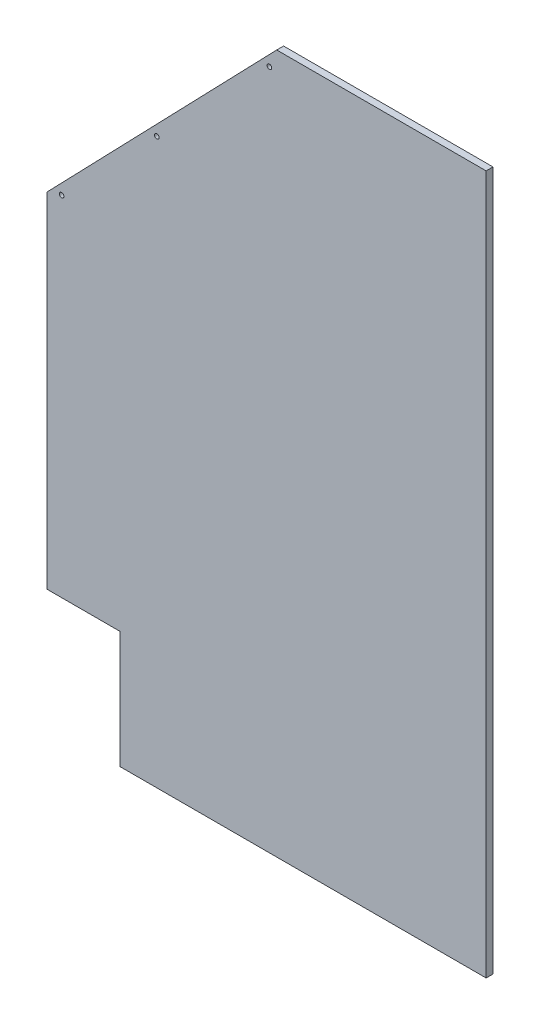
ISO-10303-21;
HEADER;
FILE_DESCRIPTION(('STEP AP214'),'2;1');
FILE_NAME('part.step','',(''),(''),'','','');
FILE_SCHEMA(('AUTOMOTIVE_DESIGN { 1 0 10303 214 1 1 1 1 }'));
ENDSEC;
DATA;
#1=APPLICATION_CONTEXT('core data for automotive mechanical design processes');
#2=APPLICATION_PROTOCOL_DEFINITION('international standard','automotive_design',2000,#1);
#3=PRODUCT_CONTEXT('',#1,'mechanical');
#4=PRODUCT('Part','Part','',(#3));
#5=PRODUCT_RELATED_PRODUCT_CATEGORY('part','',(#4));
#6=PRODUCT_DEFINITION_FORMATION('','',#4);
#7=PRODUCT_DEFINITION_CONTEXT('part definition',#1,'design');
#8=PRODUCT_DEFINITION('design','',#6,#7);
#9=PRODUCT_DEFINITION_SHAPE('','',#8);
#10=(LENGTH_UNIT() NAMED_UNIT(*) SI_UNIT(.MILLI.,.METRE.));
#11=(NAMED_UNIT(*) PLANE_ANGLE_UNIT() SI_UNIT($,.RADIAN.));
#12=(NAMED_UNIT(*) SI_UNIT($,.STERADIAN.) SOLID_ANGLE_UNIT());
#13=UNCERTAINTY_MEASURE_WITH_UNIT(LENGTH_MEASURE(1.E-05),#10,'distance_accuracy_value','');
#14=(GEOMETRIC_REPRESENTATION_CONTEXT(3) GLOBAL_UNCERTAINTY_ASSIGNED_CONTEXT((#13)) GLOBAL_UNIT_ASSIGNED_CONTEXT((#10,
#11,#12)) REPRESENTATION_CONTEXT('',''));
#15=CARTESIAN_POINT('',(0.,0.,0.));
#16=DIRECTION('',(0.,0.,1.));
#17=DIRECTION('',(1.,0.,0.));
#18=AXIS2_PLACEMENT_3D('',#15,#16,#17);
#19=CARTESIAN_POINT('',(0.,0.,0.));
#20=DIRECTION('',(0.,0.,-1.));
#21=DIRECTION('',(-1.,0.,0.));
#22=AXIS2_PLACEMENT_3D('',#19,#20,#21);
#23=PLANE('',#22);
#24=DIRECTION('',(0.,-1.,0.));
#25=VECTOR('',#24,1.);
#26=CARTESIAN_POINT('',(433.467396061269,-727.304266958425,0.));
#27=LINE('',#26,#25);
#28=CARTESIAN_POINT('',(433.467396061269,485.545733041575,0.));
#29=VERTEX_POINT('',#28);
#30=CARTESIAN_POINT('',(433.467396061269,-727.304266958425,0.));
#31=VERTEX_POINT('',#30);
#32=EDGE_CURVE('E150',#29,#31,#27,.T.);
#33=ORIENTED_EDGE('',*,*,#32,.T.);
#34=DIRECTION('',(1.,0.,0.));
#35=VECTOR('',#34,1.);
#36=CARTESIAN_POINT('',(-201.532603938731,-727.304266958425,0.));
#37=LINE('',#36,#35);
#38=CARTESIAN_POINT('',(-201.532603938731,-727.304266958425,0.));
#39=VERTEX_POINT('',#38);
#40=EDGE_CURVE('E133',#39,#31,#37,.T.);
#41=ORIENTED_EDGE('',*,*,#40,.F.);
#42=DIRECTION('',(0.,-1.,0.));
#43=VECTOR('',#42,1.);
#44=CARTESIAN_POINT('',(-201.532603938731,-524.104266958425,0.));
#45=LINE('',#44,#43);
#46=CARTESIAN_POINT('',(-201.532603938731,-524.104266958425,0.));
#47=VERTEX_POINT('',#46);
#48=EDGE_CURVE('E80',#47,#39,#45,.T.);
#49=ORIENTED_EDGE('',*,*,#48,.F.);
#50=DIRECTION('',(1.,0.,0.));
#51=VECTOR('',#50,1.);
#52=CARTESIAN_POINT('',(-328.532603938731,-524.104266958425,0.));
#53=LINE('',#52,#51);
#54=CARTESIAN_POINT('',(-328.532603938731,-524.104266958425,0.));
#55=VERTEX_POINT('',#54);
#56=EDGE_CURVE('E130',#55,#47,#53,.T.);
#57=ORIENTED_EDGE('',*,*,#56,.F.);
#58=DIRECTION('',(0.,-1.,0.));
#59=VECTOR('',#58,1.);
#60=CARTESIAN_POINT('',(-328.532603938731,72.7957330415754,0.));
#61=LINE('',#60,#59);
#62=CARTESIAN_POINT('',(-328.532603938731,72.7957330415754,0.));
#63=VERTEX_POINT('',#62);
#64=EDGE_CURVE('E111',#63,#55,#61,.T.);
#65=ORIENTED_EDGE('',*,*,#64,.F.);
#66=DIRECTION('',(-0.694658370458993,-0.719339800338655,0.));
#67=VECTOR('',#66,1.);
#68=CARTESIAN_POINT('',(-328.532603938731,72.7957330415754,0.));
#69=LINE('',#68,#67);
#70=CARTESIAN_POINT('',(70.0554378628846,485.545733041575,0.));
#71=VERTEX_POINT('',#70);
#72=EDGE_CURVE('E126',#71,#63,#69,.T.);
#73=ORIENTED_EDGE('',*,*,#72,.F.);
#74=DIRECTION('',(-1.,0.,0.));
#75=VECTOR('',#74,1.);
#76=CARTESIAN_POINT('',(70.0554378628846,485.545733041575,0.));
#77=LINE('',#76,#75);
#78=EDGE_CURVE('E124',#29,#71,#77,.T.);
#79=ORIENTED_EDGE('',*,*,#78,.F.);
#80=EDGE_LOOP('',(#33,#41,#49,#57,#65,#73,#79));
#81=FACE_BOUND('',#80,.T.);
#82=CARTESIAN_POINT('',(-303.132603938731,80.8158349586093,0.));
#83=DIRECTION('',(0.,0.,1.));
#84=DIRECTION('',(1.,0.,0.));
#85=AXIS2_PLACEMENT_3D('',#82,#83,#84);
#86=CIRCLE('',#85,3.96875000000002);
#87=CARTESIAN_POINT('',(-299.163853938731,80.8158349586093,0.));
#88=VERTEX_POINT('',#87);
#89=EDGE_CURVE('E168',#88,#88,#86,.T.);
#90=ORIENTED_EDGE('',*,*,#89,.T.);
#91=EDGE_LOOP('',(#90));
#92=FACE_BOUND('',#91,.T.);
#93=CARTESIAN_POINT('',(-138.032603938731,251.781889765434,0.));
#94=DIRECTION('',(0.,0.,1.));
#95=DIRECTION('',(1.,0.,0.));
#96=AXIS2_PLACEMENT_3D('',#93,#94,#95);
#97=CIRCLE('',#96,3.96874999999999);
#98=CARTESIAN_POINT('',(-134.063853938731,251.781889765434,0.));
#99=VERTEX_POINT('',#98);
#100=EDGE_CURVE('E162',#99,#99,#97,.T.);
#101=ORIENTED_EDGE('',*,*,#100,.T.);
#102=EDGE_LOOP('',(#101));
#103=FACE_BOUND('',#102,.T.);
#104=CARTESIAN_POINT('',(57.3554378628846,454.112130003188,0.));
#105=DIRECTION('',(0.,0.,1.));
#106=DIRECTION('',(1.,0.,0.));
#107=AXIS2_PLACEMENT_3D('',#104,#105,#106);
#108=CIRCLE('',#107,3.96875);
#109=CARTESIAN_POINT('',(61.3241878628846,454.112130003188,0.));
#110=VERTEX_POINT('',#109);
#111=EDGE_CURVE('E127',#110,#110,#108,.T.);
#112=ORIENTED_EDGE('',*,*,#111,.T.);
#113=EDGE_LOOP('',(#112));
#114=FACE_BOUND('',#113,.T.);
#115=ADVANCED_FACE('F32',(#81,#92,#103,#114),#23,.T.);
#116=CARTESIAN_POINT('',(0.,0.,11.90625));
#117=DIRECTION('',(0.,0.,-1.));
#118=DIRECTION('',(-1.,0.,0.));
#119=AXIS2_PLACEMENT_3D('',#116,#117,#118);
#120=PLANE('',#119);
#121=CARTESIAN_POINT('',(-303.132603938731,80.8158349586093,11.90625));
#122=DIRECTION('',(0.,0.,1.));
#123=DIRECTION('',(1.,0.,0.));
#124=AXIS2_PLACEMENT_3D('',#121,#122,#123);
#125=CIRCLE('',#124,3.96875000000002);
#126=CARTESIAN_POINT('',(-299.163853938731,80.8158349586093,11.90625));
#127=VERTEX_POINT('',#126);
#128=EDGE_CURVE('E171',#127,#127,#125,.T.);
#129=ORIENTED_EDGE('',*,*,#128,.F.);
#130=EDGE_LOOP('',(#129));
#131=FACE_BOUND('',#130,.T.);
#132=CARTESIAN_POINT('',(-138.032603938731,251.781889765434,11.90625));
#133=DIRECTION('',(0.,0.,1.));
#134=DIRECTION('',(1.,0.,0.));
#135=AXIS2_PLACEMENT_3D('',#132,#133,#134);
#136=CIRCLE('',#135,3.96874999999999);
#137=CARTESIAN_POINT('',(-134.063853938731,251.781889765434,11.90625));
#138=VERTEX_POINT('',#137);
#139=EDGE_CURVE('E165',#138,#138,#136,.T.);
#140=ORIENTED_EDGE('',*,*,#139,.F.);
#141=EDGE_LOOP('',(#140));
#142=FACE_BOUND('',#141,.T.);
#143=CARTESIAN_POINT('',(57.3554378628846,454.112130003188,11.90625));
#144=DIRECTION('',(0.,0.,1.));
#145=DIRECTION('',(1.,0.,0.));
#146=AXIS2_PLACEMENT_3D('',#143,#144,#145);
#147=CIRCLE('',#146,3.96875);
#148=CARTESIAN_POINT('',(61.3241878628846,454.112130003188,11.90625));
#149=VERTEX_POINT('',#148);
#150=EDGE_CURVE('E159',#149,#149,#147,.T.);
#151=ORIENTED_EDGE('',*,*,#150,.F.);
#152=EDGE_LOOP('',(#151));
#153=FACE_BOUND('',#152,.T.);
#154=DIRECTION('',(1.,0.,0.));
#155=VECTOR('',#154,1.);
#156=CARTESIAN_POINT('',(-201.532603938731,-727.304266958425,11.90625));
#157=LINE('',#156,#155);
#158=CARTESIAN_POINT('',(-201.532603938731,-727.304266958425,11.90625));
#159=VERTEX_POINT('',#158);
#160=CARTESIAN_POINT('',(433.467396061269,-727.304266958425,11.90625));
#161=VERTEX_POINT('',#160);
#162=EDGE_CURVE('E118',#159,#161,#157,.T.);
#163=ORIENTED_EDGE('',*,*,#162,.T.);
#164=DIRECTION('',(0.,-1.,0.));
#165=VECTOR('',#164,1.);
#166=CARTESIAN_POINT('',(433.467396061269,-727.304266958425,11.90625));
#167=LINE('',#166,#165);
#168=CARTESIAN_POINT('',(433.467396061269,485.545733041575,11.90625));
#169=VERTEX_POINT('',#168);
#170=EDGE_CURVE('E47',#169,#161,#167,.T.);
#171=ORIENTED_EDGE('',*,*,#170,.F.);
#172=DIRECTION('',(-1.,0.,0.));
#173=VECTOR('',#172,1.);
#174=CARTESIAN_POINT('',(70.0554378628846,485.545733041575,11.90625));
#175=LINE('',#174,#173);
#176=CARTESIAN_POINT('',(70.0554378628846,485.545733041575,11.90625));
#177=VERTEX_POINT('',#176);
#178=EDGE_CURVE('E87',#169,#177,#175,.T.);
#179=ORIENTED_EDGE('',*,*,#178,.T.);
#180=DIRECTION('',(-0.694658370458993,-0.719339800338655,0.));
#181=VECTOR('',#180,1.);
#182=CARTESIAN_POINT('',(-328.532603938731,72.7957330415754,11.90625));
#183=LINE('',#182,#181);
#184=CARTESIAN_POINT('',(-328.532603938731,72.7957330415754,11.90625));
#185=VERTEX_POINT('',#184);
#186=EDGE_CURVE('E102',#177,#185,#183,.T.);
#187=ORIENTED_EDGE('',*,*,#186,.T.);
#188=DIRECTION('',(0.,-1.,0.));
#189=VECTOR('',#188,1.);
#190=CARTESIAN_POINT('',(-328.532603938731,72.7957330415754,11.90625));
#191=LINE('',#190,#189);
#192=CARTESIAN_POINT('',(-328.532603938731,-524.104266958425,11.90625));
#193=VERTEX_POINT('',#192);
#194=EDGE_CURVE('E95',#185,#193,#191,.T.);
#195=ORIENTED_EDGE('',*,*,#194,.T.);
#196=DIRECTION('',(1.,0.,0.));
#197=VECTOR('',#196,1.);
#198=CARTESIAN_POINT('',(-328.532603938731,-524.104266958425,11.90625));
#199=LINE('',#198,#197);
#200=CARTESIAN_POINT('',(-201.532603938731,-524.104266958425,11.90625));
#201=VERTEX_POINT('',#200);
#202=EDGE_CURVE('E99',#193,#201,#199,.T.);
#203=ORIENTED_EDGE('',*,*,#202,.T.);
#204=DIRECTION('',(0.,-1.,0.));
#205=VECTOR('',#204,1.);
#206=CARTESIAN_POINT('',(-201.532603938731,-524.104266958425,11.90625));
#207=LINE('',#206,#205);
#208=EDGE_CURVE('E56',#201,#159,#207,.T.);
#209=ORIENTED_EDGE('',*,*,#208,.T.);
#210=EDGE_LOOP('',(#163,#171,#179,#187,#195,#203,#209));
#211=FACE_BOUND('',#210,.T.);
#212=ADVANCED_FACE('F97',(#131,#142,#153,#211),#120,.F.);
#213=CARTESIAN_POINT('',(70.0554378628846,485.545733041575,11.90625));
#214=DIRECTION('',(0.,-1.,0.));
#215=DIRECTION('',(0.,0.,-1.));
#216=AXIS2_PLACEMENT_3D('',#213,#214,#215);
#217=PLANE('',#216);
#218=ORIENTED_EDGE('',*,*,#178,.F.);
#219=DIRECTION('',(0.,0.,1.));
#220=VECTOR('',#219,1.);
#221=CARTESIAN_POINT('',(433.467396061269,485.545733041575,0.));
#222=LINE('',#221,#220);
#223=EDGE_CURVE('E154',#29,#169,#222,.T.);
#224=ORIENTED_EDGE('',*,*,#223,.F.);
#225=ORIENTED_EDGE('',*,*,#78,.T.);
#226=DIRECTION('',(0.,0.,-1.));
#227=VECTOR('',#226,1.);
#228=CARTESIAN_POINT('',(70.0554378628846,485.545733041575,11.90625));
#229=LINE('',#228,#227);
#230=EDGE_CURVE('E11',#177,#71,#229,.T.);
#231=ORIENTED_EDGE('',*,*,#230,.F.);
#232=EDGE_LOOP('',(#218,#224,#225,#231));
#233=FACE_BOUND('',#232,.T.);
#234=ADVANCED_FACE('F34',(#233),#217,.F.);
#235=CARTESIAN_POINT('',(-328.532603938731,72.7957330415754,11.90625));
#236=DIRECTION('',(0.719339800338655,-0.694658370458993,0.));
#237=DIRECTION('',(0.694658370458994,0.719339800338655,0.));
#238=AXIS2_PLACEMENT_3D('',#235,#236,#237);
#239=PLANE('',#238);
#240=ORIENTED_EDGE('',*,*,#72,.T.);
#241=DIRECTION('',(0.,0.,-1.));
#242=VECTOR('',#241,1.);
#243=CARTESIAN_POINT('',(-328.532603938731,72.7957330415754,11.90625));
#244=LINE('',#243,#242);
#245=EDGE_CURVE('E40',#185,#63,#244,.T.);
#246=ORIENTED_EDGE('',*,*,#245,.F.);
#247=ORIENTED_EDGE('',*,*,#186,.F.);
#248=ORIENTED_EDGE('',*,*,#230,.T.);
#249=EDGE_LOOP('',(#240,#246,#247,#248));
#250=FACE_BOUND('',#249,.T.);
#251=ADVANCED_FACE('F205',(#250),#239,.F.);
#252=CARTESIAN_POINT('',(-328.532603938731,72.7957330415754,11.90625));
#253=DIRECTION('',(1.,0.,0.));
#254=DIRECTION('',(0.,1.,0.));
#255=AXIS2_PLACEMENT_3D('',#252,#253,#254);
#256=PLANE('',#255);
#257=ORIENTED_EDGE('',*,*,#64,.T.);
#258=DIRECTION('',(0.,0.,-1.));
#259=VECTOR('',#258,1.);
#260=CARTESIAN_POINT('',(-328.532603938731,-524.104266958425,11.90625));
#261=LINE('',#260,#259);
#262=EDGE_CURVE('E108',#193,#55,#261,.T.);
#263=ORIENTED_EDGE('',*,*,#262,.F.);
#264=ORIENTED_EDGE('',*,*,#194,.F.);
#265=ORIENTED_EDGE('',*,*,#245,.T.);
#266=EDGE_LOOP('',(#257,#263,#264,#265));
#267=FACE_BOUND('',#266,.T.);
#268=ADVANCED_FACE('F109',(#267),#256,.F.);
#269=CARTESIAN_POINT('',(-328.532603938731,-524.104266958425,11.90625));
#270=DIRECTION('',(0.,1.,0.));
#271=DIRECTION('',(0.,0.,1.));
#272=AXIS2_PLACEMENT_3D('',#269,#270,#271);
#273=PLANE('',#272);
#274=ORIENTED_EDGE('',*,*,#56,.T.);
#275=DIRECTION('',(0.,0.,-1.));
#276=VECTOR('',#275,1.);
#277=CARTESIAN_POINT('',(-201.532603938731,-524.104266958425,11.90625));
#278=LINE('',#277,#276);
#279=EDGE_CURVE('E114',#201,#47,#278,.T.);
#280=ORIENTED_EDGE('',*,*,#279,.F.);
#281=ORIENTED_EDGE('',*,*,#202,.F.);
#282=ORIENTED_EDGE('',*,*,#262,.T.);
#283=EDGE_LOOP('',(#274,#280,#281,#282));
#284=FACE_BOUND('',#283,.T.);
#285=ADVANCED_FACE('F116',(#284),#273,.F.);
#286=CARTESIAN_POINT('',(-201.532603938731,-524.104266958425,11.90625));
#287=DIRECTION('',(1.,0.,0.));
#288=DIRECTION('',(0.,1.,0.));
#289=AXIS2_PLACEMENT_3D('',#286,#287,#288);
#290=PLANE('',#289);
#291=ORIENTED_EDGE('',*,*,#48,.T.);
#292=DIRECTION('',(0.,0.,-1.));
#293=VECTOR('',#292,1.);
#294=CARTESIAN_POINT('',(-201.532603938731,-727.304266958425,11.90625));
#295=LINE('',#294,#293);
#296=EDGE_CURVE('E123',#159,#39,#295,.T.);
#297=ORIENTED_EDGE('',*,*,#296,.F.);
#298=ORIENTED_EDGE('',*,*,#208,.F.);
#299=ORIENTED_EDGE('',*,*,#279,.T.);
#300=EDGE_LOOP('',(#291,#297,#298,#299));
#301=FACE_BOUND('',#300,.T.);
#302=ADVANCED_FACE('F144',(#301),#290,.F.);
#303=CARTESIAN_POINT('',(-201.532603938731,-727.304266958425,11.90625));
#304=DIRECTION('',(0.,1.,0.));
#305=DIRECTION('',(0.,0.,1.));
#306=AXIS2_PLACEMENT_3D('',#303,#304,#305);
#307=PLANE('',#306);
#308=ORIENTED_EDGE('',*,*,#40,.T.);
#309=DIRECTION('',(0.,0.,1.));
#310=VECTOR('',#309,1.);
#311=CARTESIAN_POINT('',(433.467396061269,-727.304266958425,0.));
#312=LINE('',#311,#310);
#313=EDGE_CURVE('E148',#31,#161,#312,.T.);
#314=ORIENTED_EDGE('',*,*,#313,.T.);
#315=ORIENTED_EDGE('',*,*,#162,.F.);
#316=ORIENTED_EDGE('',*,*,#296,.T.);
#317=EDGE_LOOP('',(#308,#314,#315,#316));
#318=FACE_BOUND('',#317,.T.);
#319=ADVANCED_FACE('F147',(#318),#307,.F.);
#320=CARTESIAN_POINT('',(57.3554378628846,454.112130003188,11.90625));
#321=DIRECTION('',(0.,0.,1.));
#322=DIRECTION('',(1.,0.,0.));
#323=AXIS2_PLACEMENT_3D('',#320,#321,#322);
#324=CYLINDRICAL_SURFACE('',#323,3.96875);
#325=ORIENTED_EDGE('',*,*,#111,.F.);
#326=EDGE_LOOP('',(#325));
#327=FACE_BOUND('',#326,.T.);
#328=ORIENTED_EDGE('',*,*,#150,.T.);
#329=EDGE_LOOP('',(#328));
#330=FACE_BOUND('',#329,.T.);
#331=ADVANCED_FACE('F199',(#327,#330),#324,.F.);
#332=CARTESIAN_POINT('',(-138.032603938731,251.781889765434,11.90625));
#333=DIRECTION('',(0.,0.,1.));
#334=DIRECTION('',(1.,0.,0.));
#335=AXIS2_PLACEMENT_3D('',#332,#333,#334);
#336=CYLINDRICAL_SURFACE('',#335,3.96874999999999);
#337=ORIENTED_EDGE('',*,*,#100,.F.);
#338=EDGE_LOOP('',(#337));
#339=FACE_BOUND('',#338,.T.);
#340=ORIENTED_EDGE('',*,*,#139,.T.);
#341=EDGE_LOOP('',(#340));
#342=FACE_BOUND('',#341,.T.);
#343=ADVANCED_FACE('F185',(#339,#342),#336,.F.);
#344=CARTESIAN_POINT('',(-303.132603938731,80.8158349586093,11.90625));
#345=DIRECTION('',(0.,0.,1.));
#346=DIRECTION('',(1.,0.,0.));
#347=AXIS2_PLACEMENT_3D('',#344,#345,#346);
#348=CYLINDRICAL_SURFACE('',#347,3.96875000000002);
#349=ORIENTED_EDGE('',*,*,#89,.F.);
#350=EDGE_LOOP('',(#349));
#351=FACE_BOUND('',#350,.T.);
#352=ORIENTED_EDGE('',*,*,#128,.T.);
#353=EDGE_LOOP('',(#352));
#354=FACE_BOUND('',#353,.T.);
#355=ADVANCED_FACE('F180',(#351,#354),#348,.F.);
#356=CARTESIAN_POINT('',(433.467396061269,-727.304266958425,0.));
#357=DIRECTION('',(-1.,0.,0.));
#358=DIRECTION('',(0.,0.,1.));
#359=AXIS2_PLACEMENT_3D('',#356,#357,#358);
#360=PLANE('',#359);
#361=ORIENTED_EDGE('',*,*,#170,.T.);
#362=ORIENTED_EDGE('',*,*,#313,.F.);
#363=ORIENTED_EDGE('',*,*,#32,.F.);
#364=ORIENTED_EDGE('',*,*,#223,.T.);
#365=EDGE_LOOP('',(#361,#362,#363,#364));
#366=FACE_BOUND('',#365,.T.);
#367=ADVANCED_FACE('F177',(#366),#360,.F.);
#368=CLOSED_SHELL('',(#115,#212,#234,#251,#268,#285,#302,#319,#331,#343,#355,#367));
#369=MANIFOLD_SOLID_BREP('B2',#368);
#370=ADVANCED_BREP_SHAPE_REPRESENTATION('',(#18,#369),#14);
#371=SHAPE_DEFINITION_REPRESENTATION(#9,#370);
ENDSEC;
END-ISO-10303-21;
